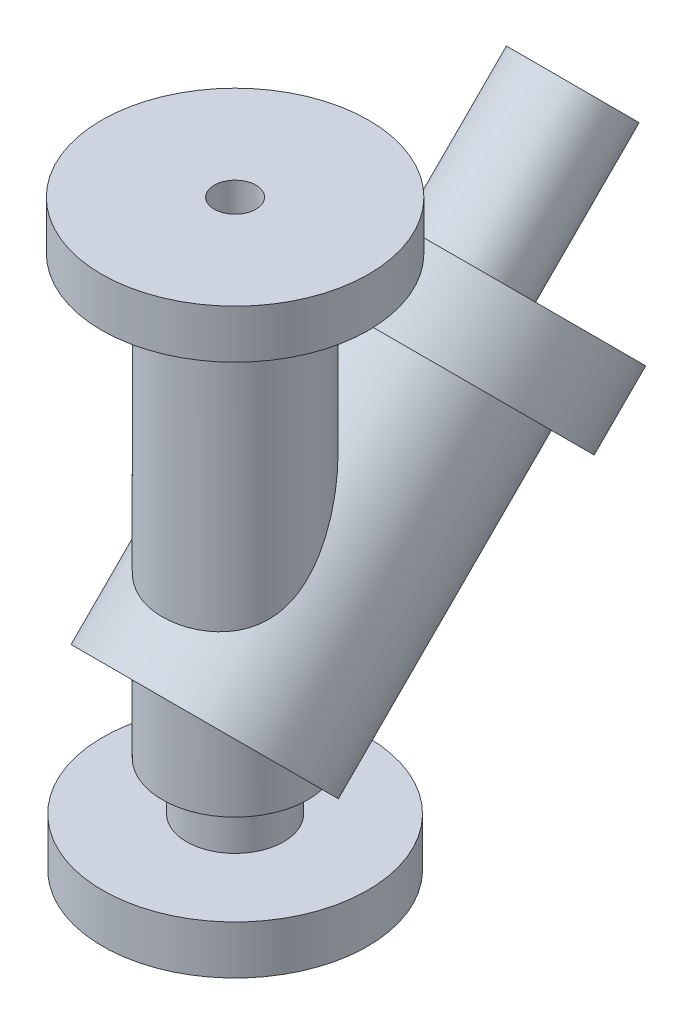
ISO-10303-21;
HEADER;
FILE_DESCRIPTION(('STEP AP214'),'2;1');
FILE_NAME('part.step','',(''),(''),'','','');
FILE_SCHEMA(('AUTOMOTIVE_DESIGN { 1 0 10303 214 1 1 1 1 }'));
ENDSEC;
DATA;
#1=APPLICATION_CONTEXT('core data for automotive mechanical design processes');
#2=APPLICATION_PROTOCOL_DEFINITION('international standard','automotive_design',2000,#1);
#3=PRODUCT_CONTEXT('',#1,'mechanical');
#4=PRODUCT('Part','Part','',(#3));
#5=PRODUCT_RELATED_PRODUCT_CATEGORY('part','',(#4));
#6=PRODUCT_DEFINITION_FORMATION('','',#4);
#7=PRODUCT_DEFINITION_CONTEXT('part definition',#1,'design');
#8=PRODUCT_DEFINITION('design','',#6,#7);
#9=PRODUCT_DEFINITION_SHAPE('','',#8);
#10=(LENGTH_UNIT() NAMED_UNIT(*) SI_UNIT(.MILLI.,.METRE.));
#11=(NAMED_UNIT(*) PLANE_ANGLE_UNIT() SI_UNIT($,.RADIAN.));
#12=(NAMED_UNIT(*) SI_UNIT($,.STERADIAN.) SOLID_ANGLE_UNIT());
#13=UNCERTAINTY_MEASURE_WITH_UNIT(LENGTH_MEASURE(1.E-05),#10,'distance_accuracy_value','');
#14=(GEOMETRIC_REPRESENTATION_CONTEXT(3) GLOBAL_UNCERTAINTY_ASSIGNED_CONTEXT((#13)) GLOBAL_UNIT_ASSIGNED_CONTEXT((#10,
#11,#12)) REPRESENTATION_CONTEXT('',''));
#15=CARTESIAN_POINT('',(0.,0.,0.));
#16=DIRECTION('',(0.,0.,1.));
#17=DIRECTION('',(1.,0.,0.));
#18=AXIS2_PLACEMENT_3D('',#15,#16,#17);
#19=CARTESIAN_POINT('',(0.,152.4,0.));
#20=DIRECTION('',(0.,-1.,0.));
#21=DIRECTION('',(0.,0.,-1.));
#22=AXIS2_PLACEMENT_3D('',#19,#20,#21);
#23=CYLINDRICAL_SURFACE('',#22,19.05);
#24=CARTESIAN_POINT('',(0.,104.929873903962,-19.05));
#25=CARTESIAN_POINT('',(-0.267009906651442,104.929877124801,-19.0500015955188));
#26=CARTESIAN_POINT('',(-0.533997791989519,104.918941830051,-19.0443737127495));
#27=CARTESIAN_POINT('',(-1.06571573927213,104.875538104068,-19.0220277013723));
#28=CARTESIAN_POINT('',(-1.33044604152047,104.843071994361,-19.0053107684242));
#29=CARTESIAN_POINT('',(-1.85584052785153,104.757496276019,-18.9612215721552));
#30=CARTESIAN_POINT('',(-2.11650127472153,104.704370105082,-18.9338407600244));
#31=CARTESIAN_POINT('',(-2.63187326271433,104.578872624724,-18.869108057032));
#32=CARTESIAN_POINT('',(-2.8865836066686,104.506498433308,-18.8317546729796));
#33=CARTESIAN_POINT('',(-3.4512221544691,104.323990811808,-18.7374641875761));
#34=CARTESIAN_POINT('',(-3.75913957224057,104.208943392837,-18.6779671382901));
#35=CARTESIAN_POINT('',(-4.3621005332743,103.95499212376,-18.5464261974273));
#36=CARTESIAN_POINT('',(-4.65714061774455,103.816081913071,-18.4743789605494));
#37=CARTESIAN_POINT('',(-5.52267661532365,103.368318141473,-18.2417048611953));
#38=CARTESIAN_POINT('',(-6.07299815278931,103.028633911163,-18.0646498055544));
#39=CARTESIAN_POINT('',(-7.02299807661898,102.359318279681,-17.7140478372508));
#40=CARTESIAN_POINT('',(-7.43176629372052,102.039330464189,-17.545846025037));
#41=CARTESIAN_POINT('',(-8.21668630471617,101.369716113327,-17.1922588623011));
#42=CARTESIAN_POINT('',(-8.59281576517244,101.020069602177,-17.0068619225081));
#43=CARTESIAN_POINT('',(-9.31567536291714,100.297826758976,-16.6219344606117));
#44=CARTESIAN_POINT('',(-9.66235570397833,99.9251933243599,-16.4223810066575));
#45=CARTESIAN_POINT('',(-10.3287874869254,99.162515873639,-16.0116164951536));
#46=CARTESIAN_POINT('',(-10.6485287606971,98.7724653677207,-15.800401085166));
#47=CARTESIAN_POINT('',(-11.2588363570715,97.9850917072852,-15.3713391294279));
#48=CARTESIAN_POINT('',(-11.5497767985285,97.5879737098165,-15.1536452403363));
#49=CARTESIAN_POINT('',(-12.1101224360225,96.7836154725401,-14.7096963045043));
#50=CARTESIAN_POINT('',(-12.3795304661401,96.3763765741185,-14.4834423902231));
#51=CARTESIAN_POINT('',(-12.8989262044688,95.5535406848813,-14.0228661822539));
#52=CARTESIAN_POINT('',(-13.1488954917535,95.1379362248209,-13.7885365319139));
#53=CARTESIAN_POINT('',(-13.6306653785616,94.3004901021073,-13.3124804156925));
#54=CARTESIAN_POINT('',(-13.8624654589282,93.8786482616397,-13.0707537387267));
#55=CARTESIAN_POINT('',(-14.3098769121617,93.0287874775481,-12.5793754319443));
#56=CARTESIAN_POINT('',(-14.5254323060473,92.6007527372258,-12.3297002707768));
#57=CARTESIAN_POINT('',(-14.9405209068686,91.7411214012904,-11.823303709162));
#58=CARTESIAN_POINT('',(-15.1400543249961,91.3095248527096,-11.5665824016525));
#59=CARTESIAN_POINT('',(-15.5238237428971,90.4440293946605,-11.0461702362674));
#60=CARTESIAN_POINT('',(-15.7080660837712,90.010131519759,-10.7824823278036));
#61=CARTESIAN_POINT('',(-16.0619489605107,89.1408358691651,-10.2478801057345));
#62=CARTESIAN_POINT('',(-16.2315893174273,88.705438075159,-9.97696570362107));
#63=CARTESIAN_POINT('',(-16.5771047811677,87.7793431611689,-9.39314541336794));
#64=CARTESIAN_POINT('',(-16.7510867218115,87.288569170848,-9.07923924780995));
#65=CARTESIAN_POINT('',(-17.081404474407,86.307590074086,-8.44139257463615));
#66=CARTESIAN_POINT('',(-17.2377399379828,85.817384979065,-8.11745186907981));
#67=CARTESIAN_POINT('',(-17.5328707914166,84.8386022009264,-7.45863973165529));
#68=CARTESIAN_POINT('',(-17.6716561225594,84.350025605945,-7.12376216851334));
#69=CARTESIAN_POINT('',(-17.9312902822868,83.3762244132712,-6.44237977729743));
#70=CARTESIAN_POINT('',(-18.0521394673175,82.8909997491484,-6.09587518045609));
#71=CARTESIAN_POINT('',(-18.2747897834614,81.9275474633776,-5.39169260400928));
#72=CARTESIAN_POINT('',(-18.3766696959188,81.4492988670831,-5.03406837781814));
#73=CARTESIAN_POINT('',(-18.5609900787698,80.4994976849631,-4.30505847509164));
#74=CARTESIAN_POINT('',(-18.6434291662506,80.0279455777297,-3.93367182174641));
#75=CARTESIAN_POINT('',(-18.7872929804933,79.0941888793937,-3.17625361290259));
#76=CARTESIAN_POINT('',(-18.8487379182231,78.631975703467,-2.7902365421195));
#77=CARTESIAN_POINT('',(-18.9486749225377,77.7191256470406,-2.00200537017117));
#78=CARTESIAN_POINT('',(-18.9871724384102,77.2684860425258,-1.59979513860814));
#79=CARTESIAN_POINT('',(-19.0367319764828,76.4134085507067,-0.807185836171903));
#80=CARTESIAN_POINT('',(-19.0495528387087,76.0079660779016,-0.417986021192688));
#81=CARTESIAN_POINT('',(-19.0504241997063,75.2127243599245,0.376156773187768));
#82=CARTESIAN_POINT('',(-19.0384766937626,74.8229238572487,0.781098481878454));
#83=CARTESIAN_POINT('',(-18.9866192768058,74.0625857341306,1.6068036252037));
#84=CARTESIAN_POINT('',(-18.9467200896439,73.6920407847108,2.02756093350896));
#85=CARTESIAN_POINT('',(-18.8353163814849,72.9739884690959,2.88443663295627));
#86=CARTESIAN_POINT('',(-18.7638112570611,72.6264815428929,3.32055531723436));
#87=CARTESIAN_POINT('',(-18.5840328166851,71.9539519889694,4.21261013207123));
#88=CARTESIAN_POINT('',(-18.4752526941285,71.6293178870567,4.66873954212559));
#89=CARTESIAN_POINT('',(-18.2172588753814,71.01224462937,5.59135766968807));
#90=CARTESIAN_POINT('',(-18.068047028027,70.7198040023327,6.05784591261882));
#91=CARTESIAN_POINT('',(-17.7261849504042,70.1708331946425,6.99523639633095));
#92=CARTESIAN_POINT('',(-17.5335911156406,69.9142570865692,7.46613215245236));
#93=CARTESIAN_POINT('',(-17.1028855641815,69.4384889119164,8.40599698235498));
#94=CARTESIAN_POINT('',(-16.8647806608429,69.2192912587775,8.87496633381236));
#95=CARTESIAN_POINT('',(-16.3763768184818,68.8440742559226,9.74330751440538));
#96=CARTESIAN_POINT('',(-16.1316054786585,68.6835532719279,10.1438587013558));
#97=CARTESIAN_POINT('',(-15.6079897041798,68.3895571804856,10.9323861643844));
#98=CARTESIAN_POINT('',(-15.3291476249674,68.2560802050742,11.3203633074116));
#99=CARTESIAN_POINT('',(-14.7386771459008,68.0139426770407,12.0791220227073));
#100=CARTESIAN_POINT('',(-14.4270263510976,67.9052992381122,12.449891597219));
#101=CARTESIAN_POINT('',(-13.7731498564126,67.7101655355878,13.1696334152723));
#102=CARTESIAN_POINT('',(-13.4309238905469,67.6236754647368,13.5186054691448));
#103=CARTESIAN_POINT('',(-12.7385239704174,67.4741401485616,14.1720203676467));
#104=CARTESIAN_POINT('',(-12.3898955606616,67.4100451932685,14.4778655422354));
#105=CARTESIAN_POINT('',(-11.6698427314182,67.2962431304556,15.0642906640596));
#106=CARTESIAN_POINT('',(-11.2984196667045,67.246535168863,15.344872110375));
#107=CARTESIAN_POINT('',(-10.5351052731293,67.1590323260952,15.8786316760456));
#108=CARTESIAN_POINT('',(-10.14321535888,67.1212366228443,16.1318116856065));
#109=CARTESIAN_POINT('',(-9.34129787267234,67.0552966179366,16.6090457273214));
#110=CARTESIAN_POINT('',(-8.93126914970987,67.0271529297462,16.8330979075961));
#111=CARTESIAN_POINT('',(-8.05902924726748,66.976409537401,17.2688289323526));
#112=CARTESIAN_POINT('',(-7.59538531394566,66.9545071408557,17.4777257945609));
#113=CARTESIAN_POINT('',(-6.65263796052381,66.9176008484949,17.8578629620113));
#114=CARTESIAN_POINT('',(-6.17353381394726,66.9025972773624,18.0291014947224));
#115=CARTESIAN_POINT('',(-5.20291640238031,66.8777482698401,18.3327793764631));
#116=CARTESIAN_POINT('',(-4.71139995271479,66.8679041716252,18.4652086558963));
#117=CARTESIAN_POINT('',(-3.71928914545974,66.852058362118,18.6903223096332));
#118=CARTESIAN_POINT('',(-3.21869466111837,66.8460567045183,18.7830061285458));
#119=CARTESIAN_POINT('',(-2.18970365959683,66.8367839776397,18.9311784345093));
#120=CARTESIAN_POINT('',(-1.66104630597213,66.8336433138397,18.9848698111441));
#121=CARTESIAN_POINT('',(-0.601074789870358,66.8299796075181,19.0479161524016));
#122=CARTESIAN_POINT('',(-0.0697605415935067,66.8294566500843,19.057269675833));
#123=CARTESIAN_POINT('',(0.9918236624238,66.8309302146658,19.0315712044242));
#124=CARTESIAN_POINT('',(1.52209355314277,66.8329268888773,18.9965165271402));
#125=CARTESIAN_POINT('',(2.57783232287044,66.8398110506646,18.8822454353525));
#126=CARTESIAN_POINT('',(3.10330121795305,66.8446985285582,18.8030291687584));
#127=CARTESIAN_POINT('',(4.14927501493832,66.8582550079976,18.6003149438458));
#128=CARTESIAN_POINT('',(4.66972224931263,66.8669493795394,18.4765209095688));
#129=CARTESIAN_POINT('',(5.69827342865243,66.8894810147836,18.1856484973509));
#130=CARTESIAN_POINT('',(6.2063772344809,66.9033183364295,18.018569631744));
#131=CARTESIAN_POINT('',(7.2066515236115,66.9380027553575,17.6423425768452));
#132=CARTESIAN_POINT('',(7.69881851964043,66.958851375631,17.4331852512571));
#133=CARTESIAN_POINT('',(8.6634497898219,67.0099354468133,16.9744618024075));
#134=CARTESIAN_POINT('',(9.13591425559491,67.0401708064056,16.7248960722604));
#135=CARTESIAN_POINT('',(10.0537939018391,67.1126173127173,16.1896162261133));
#136=CARTESIAN_POINT('',(10.4993976777596,67.1547291536965,15.9042123118299));
#137=CARTESIAN_POINT('',(11.3642262237892,67.2542961334591,15.2982226875647));
#138=CARTESIAN_POINT('',(11.7834508661227,67.3117513465559,14.9776368071886));
#139=CARTESIAN_POINT('',(12.5919054044275,67.4455919257159,14.3046446410037));
#140=CARTESIAN_POINT('',(12.9811530271698,67.5219659897607,13.9522574327428));
#141=CARTESIAN_POINT('',(13.7267190955125,67.6974585176767,13.2194110233932));
#142=CARTESIAN_POINT('',(14.0830400163127,67.796575269957,12.8389539362754));
#143=CARTESIAN_POINT('',(14.7412106740335,68.0150198359984,12.0763703875601));
#144=CARTESIAN_POINT('',(15.0449817323992,68.1329295000256,11.6954960253473));
#145=CARTESIAN_POINT('',(15.6186421685419,68.3950033552871,10.9176012695559));
#146=CARTESIAN_POINT('',(15.8885335917983,68.5391659602137,10.5205818526512));
#147=CARTESIAN_POINT('',(16.3929739392817,68.855547201103,9.71587711635006));
#148=CARTESIAN_POINT('',(16.6275489238865,69.0277449523885,9.30819992475349));
#149=CARTESIAN_POINT('',(17.0611763888053,69.4011390066832,8.48729913632562));
#150=CARTESIAN_POINT('',(17.2602301672139,69.6023342495162,8.07407574276951));
#151=CARTESIAN_POINT('',(17.6092461889304,70.0166085035173,7.27945265965943));
#152=CARTESIAN_POINT('',(17.7618223172347,70.2275465742856,6.89807719408002));
#153=CARTESIAN_POINT('',(18.038377064408,70.672684963061,6.13862960810494));
#154=CARTESIAN_POINT('',(18.1623577552795,70.9068835938664,5.76055725027992));
#155=CARTESIAN_POINT('',(18.383423457837,71.3968947215594,5.01050934363137));
#156=CARTESIAN_POINT('',(18.4805003027898,71.6527137506917,4.63853567824933));
#157=CARTESIAN_POINT('',(18.6497315336113,72.1838213752925,3.90288597096551));
#158=CARTESIAN_POINT('',(18.7218823169992,72.4591127781175,3.53921113555372));
#159=CARTESIAN_POINT('',(18.830430980913,72.9662645672377,2.89816246467469));
#160=CARTESIAN_POINT('',(18.8711720332656,73.1948681396291,2.61892274416046));
#161=CARTESIAN_POINT('',(18.9395891162268,73.6615813345527,2.0668366703548));
#162=CARTESIAN_POINT('',(18.9672635363239,73.8996921249647,1.79399110910413));
#163=CARTESIAN_POINT('',(19.0322050660295,74.6268391479508,0.985192808650225));
#164=CARTESIAN_POINT('',(19.0513687970981,75.1285834183464,0.459112170454146));
#165=CARTESIAN_POINT('',(19.048474410192,76.1597703076458,-0.568435464011953));
#166=CARTESIAN_POINT('',(19.026264247399,76.6893081132372,-1.06980469646597));
#167=CARTESIAN_POINT('',(18.9459842132393,77.7680583373719,-2.0476216229285));
#168=CARTESIAN_POINT('',(18.887917699071,78.3172689094372,-2.52407164557108));
#169=CARTESIAN_POINT('',(18.7468234128673,79.3798391750629,-3.41209732284076));
#170=CARTESIAN_POINT('',(18.6665355710914,79.8919355923275,-3.82563862648874));
#171=CARTESIAN_POINT('',(18.4820162417541,80.9252578425515,-4.63575004300507));
#172=CARTESIAN_POINT('',(18.3777805721785,81.4464852553557,-5.03231717730466));
#173=CARTESIAN_POINT('',(18.1468340945311,82.4958707489965,-5.81030812880027));
#174=CARTESIAN_POINT('',(18.0201047058195,83.0240342226925,-6.19171910520644));
#175=CARTESIAN_POINT('',(17.7451946752965,84.0846868515724,-6.94043076383144));
#176=CARTESIAN_POINT('',(17.5970153141743,84.6171757467129,-7.30773228681183));
#177=CARTESIAN_POINT('',(17.279663388491,85.6845663736649,-8.02938878184655));
#178=CARTESIAN_POINT('',(17.1104929746766,86.2194678528798,-8.38374507546329));
#179=CARTESIAN_POINT('',(16.7511366349376,87.2900210619187,-9.08050527149966));
#180=CARTESIAN_POINT('',(16.5609499394856,87.8256728185051,-9.42290873565272));
#181=CARTESIAN_POINT('',(16.1592808472146,88.8956582776762,-10.0962228364535));
#182=CARTESIAN_POINT('',(15.9478131297234,89.4299926318551,-10.4271411863186));
#183=CARTESIAN_POINT('',(15.5026621408309,90.4959272309863,-11.0781513078713));
#184=CARTESIAN_POINT('',(15.2689808850311,91.0275277193974,-11.3982440582802));
#185=CARTESIAN_POINT('',(14.7459112581444,92.1556609127138,-12.0691592423252));
#186=CARTESIAN_POINT('',(14.4532368005875,92.7515590154366,-12.418501344432));
#187=CARTESIAN_POINT('',(13.8352726280303,93.9343692932322,-13.1034545819851));
#188=CARTESIAN_POINT('',(13.5099809201526,94.5212809167127,-13.4390648766673));
#189=CARTESIAN_POINT('',(12.8237036590629,95.6815119023501,-14.0954054548285));
#190=CARTESIAN_POINT('',(12.4627595339513,96.2548461026118,-14.4161523871102));
#191=CARTESIAN_POINT('',(11.8910630468379,97.100976032471,-14.885083188768));
#192=CARTESIAN_POINT('',(11.6954651185635,97.3806889577769,-15.0393518128724));
#193=CARTESIAN_POINT('',(11.2934616480785,97.9346547047492,-15.3435257025243));
#194=CARTESIAN_POINT('',(11.0870567673567,98.208907859191,-15.4934312342631));
#195=CARTESIAN_POINT('',(10.5854913221852,98.8495588279655,-15.8421640915366));
#196=CARTESIAN_POINT('',(10.2853512469721,99.2131952807221,-16.0389569078196));
#197=CARTESIAN_POINT('',(9.66132881200667,99.9253265614288,-16.4224040407378));
#198=CARTESIAN_POINT('',(9.33744349987313,100.27381949789,-16.6090570915979));
#199=CARTESIAN_POINT('',(8.66401195364686,100.950897237666,-16.9700674017581));
#200=CARTESIAN_POINT('',(8.31450280033963,101.279509600137,-17.1444417399318));
#201=CARTESIAN_POINT('',(7.58698967035173,101.911667947613,-17.4785641567437));
#202=CARTESIAN_POINT('',(7.20900064413373,102.215226911387,-17.63831981323));
#203=CARTESIAN_POINT('',(6.56883505548972,102.682845946557,-17.8835878942573));
#204=CARTESIAN_POINT('',(6.31594232667944,102.856761383559,-17.9745954054757));
#205=CARTESIAN_POINT('',(5.79760551798091,103.189570778865,-18.1484160777981));
#206=CARTESIAN_POINT('',(5.53215910720428,103.348461930998,-18.2312277082449));
#207=CARTESIAN_POINT('',(4.98880780329007,103.648488680961,-18.3873366450106));
#208=CARTESIAN_POINT('',(4.71090779691706,103.789631162002,-18.460637640055));
#209=CARTESIAN_POINT('',(4.14307799234554,104.051223984334,-18.5963041619315));
#210=CARTESIAN_POINT('',(3.85315517854338,104.171686136019,-18.658675930793));
#211=CARTESIAN_POINT('',(3.27595346005935,104.383835762157,-18.7683999480433));
#212=CARTESIAN_POINT('',(2.9891817026625,104.476603098772,-18.8163169521801));
#213=CARTESIAN_POINT('',(2.4070867173598,104.637960586895,-18.899598615989));
#214=CARTESIAN_POINT('',(2.11176399900204,104.706552175829,-18.9349640219474));
#215=CARTESIAN_POINT('',(1.5153308403487,104.817215339596,-18.9919945078179));
#216=CARTESIAN_POINT('',(1.21423026434197,104.859328576105,-19.0136811104606));
#217=CARTESIAN_POINT('',(0.608743272382473,104.915654038574,-19.042681925187));
#218=CARTESIAN_POINT('',(0.304357329934899,104.929870232615,-19.0499981813115));
#219=CARTESIAN_POINT('',(0.,104.929873903962,-19.05));
#220=B_SPLINE_CURVE_WITH_KNOTS('',3,(#24,#25,#26,#27,#28,#29,#30,#31,#32,#33,#34,#35,#36,#37,
#38,#39,#40,#41,#42,#43,#44,#45,#46,#47,#48,#49,#50,#51,#52,#53,#54,#55,#56,#57,#58,#59,#60,#61,
#62,#63,#64,#65,#66,#67,#68,#69,#70,#71,#72,#73,#74,#75,#76,#77,#78,#79,#80,#81,#82,#83,#84,#85,
#86,#87,#88,#89,#90,#91,#92,#93,#94,#95,#96,#97,#98,#99,#100,#101,#102,#103,#104,#105,#106,#107,
#108,#109,#110,#111,#112,#113,#114,#115,#116,#117,#118,#119,#120,#121,#122,#123,#124,#125,#126,
#127,#128,#129,#130,#131,#132,#133,#134,#135,#136,#137,#138,#139,#140,#141,#142,#143,#144,#145,
#146,#147,#148,#149,#150,#151,#152,#153,#154,#155,#156,#157,#158,#159,#160,#161,#162,#163,#164,
#165,#166,#167,#168,#169,#170,#171,#172,#173,#174,#175,#176,#177,#178,#179,#180,#181,#182,#183,
#184,#185,#186,#187,#188,#189,#190,#191,#192,#193,#194,#195,#196,#197,#198,#199,#200,#201,#202,
#203,#204,#205,#206,#207,#208,#209,#210,#211,#212,#213,#214,#215,#216,#217,#218,#219),
.UNSPECIFIED.,.T.,.F.,(4,2,2,2,2,2,2,2,2,2,2,2,2,2,2,2,2,2,2,2,2,2,2,2,2,2,2,2,2,2,2,2,2,2,2,2,
2,2,2,2,2,2,2,2,2,2,2,2,2,2,2,2,2,2,2,2,2,2,2,2,2,2,2,2,2,2,2,2,2,2,2,2,2,2,2,2,2,2,2,2,2,2,2,2,
2,2,2,2,2,2,2,2,2,2,2,2,2,4),(0.,0.800712843955493,1.60133936631104,2.40260904477865,
3.20399876452086,4.20457298011912,5.20541431192065,7.20897089637736,8.84399584968337,
10.4801309074278,12.1189796478342,13.7584442238176,15.3726054987658,16.9865539678979,
18.6020136985121,20.2175195715536,21.8383595263883,23.4591781128151,25.0793211634962,
26.6994840663727,28.5231444653239,30.3468408605894,32.1715778002674,33.9962784719717,
35.813223157982,37.6302970524307,39.4456166969422,41.2605050884779,42.9461243411954,
44.6316078094527,46.3164449844723,48.0013143281163,49.7100659700834,51.418739488521,
53.1252044634634,54.8314141672968,56.3177021357741,57.8038874094448,59.2910938002439,
60.7783131300222,62.1813766504321,63.5843568619845,64.987240231407,66.390212749305,
67.9155073025332,69.4408736341317,70.9666353933722,72.4924184724515,74.0846989265194,
75.6770311369244,77.2694595355323,78.8618826006723,80.4650834075347,82.0683022775477,
83.6718696232808,85.2754213695956,86.8659434266024,88.4564731872081,90.0460550558439,
91.6355173334264,93.137216476667,94.6388249113342,96.1393198042104,97.6397598514502,
99.0235149811074,100.407169813463,101.791244198991,103.175518536584,104.264606723348,
105.353829109297,107.532789062048,109.719772270109,111.906550743903,113.895095582905,
115.883987946216,117.874530919206,119.86495509409,121.855175497933,123.845468799397,
125.834398516163,127.823147934326,130.072902229253,132.322794065507,134.57010161438,
135.693603092419,136.817035881641,138.349027691027,139.881210305825,141.4112178442,
142.940427729692,143.900231731978,144.860214649688,145.819824115298,146.778883718234,
147.693220913461,148.607503735405,149.520344378916,150.433055170388),.UNSPECIFIED.);
#221=CARTESIAN_POINT('',(0.,104.929873903962,-19.05));
#222=VERTEX_POINT('',#221);
#223=EDGE_CURVE('E94',#222,#222,#220,.T.);
#224=ORIENTED_EDGE('',*,*,#223,.T.);
#225=EDGE_LOOP('',(#224));
#226=FACE_BOUND('',#225,.T.);
#227=CARTESIAN_POINT('',(0.,139.7,0.));
#228=DIRECTION('',(0.,1.,0.));
#229=DIRECTION('',(0.,0.,1.));
#230=AXIS2_PLACEMENT_3D('',#227,#228,#229);
#231=CIRCLE('',#230,19.05);
#232=CARTESIAN_POINT('',(0.,139.7,19.05));
#233=VERTEX_POINT('',#232);
#234=EDGE_CURVE('E12',#233,#233,#231,.T.);
#235=ORIENTED_EDGE('',*,*,#234,.F.);
#236=EDGE_LOOP('',(#235));
#237=FACE_BOUND('',#236,.T.);
#238=ADVANCED_FACE('F32',(#226,#237),#23,.T.);
#239=CARTESIAN_POINT('',(0.,106.681360679575,-61.2126393204245));
#240=DIRECTION('',(0.,0.707106781186551,-0.707106781186544));
#241=DIRECTION('',(0.,0.707106781186544,0.707106781186551));
#242=AXIS2_PLACEMENT_3D('',#239,#240,#241);
#243=PLANE('',#242);
#244=CARTESIAN_POINT('',(0.,106.681360679575,-61.2126393204245));
#245=DIRECTION('',(0.,-0.707106781186551,0.707106781186544));
#246=DIRECTION('',(0.,-0.707106781186544,-0.707106781186551));
#247=AXIS2_PLACEMENT_3D('',#244,#245,#246);
#248=CIRCLE('',#247,37.719);
#249=CARTESIAN_POINT('',(0.,80.01,-87.884));
#250=VERTEX_POINT('',#249);
#251=EDGE_CURVE('E153',#250,#250,#248,.T.);
#252=ORIENTED_EDGE('',*,*,#251,.F.);
#253=EDGE_LOOP('',(#252));
#254=FACE_BOUND('',#253,.T.);
#255=CARTESIAN_POINT('',(0.,106.681360679575,-61.2126393204245));
#256=DIRECTION('',(0.,0.707106781186551,-0.707106781186544));
#257=DIRECTION('',(0.,0.707106781186544,0.707106781186551));
#258=AXIS2_PLACEMENT_3D('',#255,#256,#257);
#259=CIRCLE('',#258,14.1871203416822);
#260=CARTESIAN_POINT('',(0.,116.713169678688,-51.1808303213113));
#261=VERTEX_POINT('',#260);
#262=EDGE_CURVE('E146',#261,#261,#259,.T.);
#263=ORIENTED_EDGE('',*,*,#262,.F.);
#264=EDGE_LOOP('',(#263));
#265=FACE_BOUND('',#264,.T.);
#266=ADVANCED_FACE('F110',(#254,#265),#243,.T.);
#267=CARTESIAN_POINT('',(0.,25.4,0.));
#268=DIRECTION('',(0.,-1.,0.));
#269=DIRECTION('',(0.,0.,-1.));
#270=AXIS2_PLACEMENT_3D('',#267,#268,#269);
#271=CYLINDRICAL_SURFACE('',#270,12.7);
#272=CARTESIAN_POINT('',(0.,12.7,0.));
#273=DIRECTION('',(0.,-1.,0.));
#274=DIRECTION('',(0.,0.,-1.));
#275=AXIS2_PLACEMENT_3D('',#272,#273,#274);
#276=CIRCLE('',#275,12.7);
#277=CARTESIAN_POINT('',(0.,12.7,-12.7));
#278=VERTEX_POINT('',#277);
#279=EDGE_CURVE('E87',#278,#278,#276,.T.);
#280=ORIENTED_EDGE('',*,*,#279,.F.);
#281=EDGE_LOOP('',(#280));
#282=FACE_BOUND('',#281,.T.);
#283=CARTESIAN_POINT('',(0.,29.5980557355349,0.));
#284=DIRECTION('',(0.,0.707106781186551,-0.707106781186544));
#285=DIRECTION('',(0.,-0.707106781186544,-0.707106781186551));
#286=AXIS2_PLACEMENT_3D('',#283,#284,#285);
#287=ELLIPSE('',#286,17.9605122421382,12.7);
#288=CARTESIAN_POINT('',(-3.92295310446291,17.5191303305089,-12.0789254050261));
#289=VERTEX_POINT('',#288);
#290=CARTESIAN_POINT('',(-11.9860889384879,25.4,-4.19805573553491));
#291=VERTEX_POINT('',#290);
#292=EDGE_CURVE('E48',#289,#291,#287,.T.);
#293=ORIENTED_EDGE('',*,*,#292,.F.);
#294=CARTESIAN_POINT('',(-3.92295310446291,17.5191303305089,-12.0789254050261));
#295=CARTESIAN_POINT('',(-3.76285993056821,17.5397438605781,-12.1309206375009));
#296=CARTESIAN_POINT('',(-3.60158952452861,17.5589511416917,-12.1797775664688));
#297=CARTESIAN_POINT('',(-3.27695013107085,17.5946168798933,-12.2711056937808));
#298=CARTESIAN_POINT('',(-3.11358114213913,17.6110753349985,-12.313576887519));
#299=CARTESIAN_POINT('',(-2.62081487810544,17.6564133249643,-12.4312231485566));
#300=CARTESIAN_POINT('',(-2.2886562441496,17.6812685024924,-12.4966640749915));
#301=CARTESIAN_POINT('',(-1.62882156963224,17.7200572255834,-12.5994203055092));
#302=CARTESIAN_POINT('',(-1.30127317243977,17.7342721249416,-12.6374590755999));
#303=CARTESIAN_POINT('',(-0.643935535587166,17.7531012989664,-12.6879464114579));
#304=CARTESIAN_POINT('',(-0.314146385172248,17.7577159537709,-12.7003959904721));
#305=CARTESIAN_POINT('',(0.342864914606357,17.7574156909785,-12.6995878994325));
#306=CARTESIAN_POINT('',(0.670087358454526,17.7525735682131,-12.6865266027568));
#307=CARTESIAN_POINT('',(1.32226961106467,17.7334326820859,-12.6352133395727));
#308=CARTESIAN_POINT('',(1.64722935980012,17.7191336688031,-12.5969607073227));
#309=CARTESIAN_POINT('',(2.30177528061324,17.6803262570148,-12.4941820231705));
#310=CARTESIAN_POINT('',(2.63123569594599,17.6555428403554,-12.4289493673958));
#311=CARTESIAN_POINT('',(3.12002906687034,17.610436317138,-12.3119263825077));
#312=CARTESIAN_POINT('',(3.28208639490022,17.5940756252599,-12.2697146841832));
#313=CARTESIAN_POINT('',(3.60413315298851,17.5586481248609,-12.1790067616979));
#314=CARTESIAN_POINT('',(3.76412258405859,17.539581317664,-12.1305105406118));
#315=CARTESIAN_POINT('',(3.92295310446291,17.5191303305089,-12.0789254050261));
#316=B_SPLINE_CURVE_WITH_KNOTS('',3,(#294,#295,#296,#297,#298,#299,#300,#301,#302,#303,#304,
#305,#306,#307,#308,#309,#310,#311,#312,#313,#314,#315),.UNSPECIFIED.,.F.,.F.,(4,2,2,2,2,2,2,2,
2,2,4),(0.,0.508665313340147,1.01733099356859,2.03433910781017,3.02340018537466,4.0124220986517,
4.99386088161903,5.97532560250374,6.98430949573214,7.48896453722722,7.99361933182093),.UNSPECIFIED.);
#317=CARTESIAN_POINT('',(3.92295310446289,17.5191303305089,-12.0789254050261));
#318=VERTEX_POINT('',#317);
#319=EDGE_CURVE('E52',#289,#318,#316,.T.);
#320=ORIENTED_EDGE('',*,*,#319,.T.);
#321=CARTESIAN_POINT('',(11.9860889384879,25.4,-4.19805573553491));
#322=VERTEX_POINT('',#321);
#323=EDGE_CURVE('E82',#322,#318,#287,.T.);
#324=ORIENTED_EDGE('',*,*,#323,.F.);
#325=CARTESIAN_POINT('',(0.,25.4,0.));
#326=DIRECTION('',(0.,1.,0.));
#327=DIRECTION('',(0.,0.,1.));
#328=AXIS2_PLACEMENT_3D('',#325,#326,#327);
#329=CIRCLE('',#328,12.7);
#330=EDGE_CURVE('E80',#291,#322,#329,.T.);
#331=ORIENTED_EDGE('',*,*,#330,.F.);
#332=EDGE_LOOP('',(#293,#320,#324,#331));
#333=FACE_BOUND('',#332,.T.);
#334=ADVANCED_FACE('F34',(#282,#333),#271,.T.);
#335=CARTESIAN_POINT('',(0.,25.4,0.));
#336=DIRECTION('',(0.,-1.,0.));
#337=DIRECTION('',(0.,0.,-1.));
#338=AXIS2_PLACEMENT_3D('',#335,#336,#337);
#339=CYLINDRICAL_SURFACE('',#338,5.461);
#340=CARTESIAN_POINT('',(0.,0.,0.));
#341=DIRECTION('',(0.,1.,0.));
#342=DIRECTION('',(0.,0.,1.));
#343=AXIS2_PLACEMENT_3D('',#340,#341,#342);
#344=CIRCLE('',#343,5.461);
#345=CARTESIAN_POINT('',(0.,0.,5.461));
#346=VERTEX_POINT('',#345);
#347=EDGE_CURVE('E73',#346,#346,#344,.T.);
#348=ORIENTED_EDGE('',*,*,#347,.F.);
#349=EDGE_LOOP('',(#348));
#350=FACE_BOUND('',#349,.T.);
#351=CARTESIAN_POINT('',(0.,152.4,0.));
#352=DIRECTION('',(0.,-1.,0.));
#353=DIRECTION('',(0.,0.,-1.));
#354=AXIS2_PLACEMENT_3D('',#351,#352,#353);
#355=CIRCLE('',#354,5.461);
#356=CARTESIAN_POINT('',(0.,152.4,-5.461));
#357=VERTEX_POINT('',#356);
#358=EDGE_CURVE('E137',#357,#357,#355,.T.);
#359=ORIENTED_EDGE('',*,*,#358,.F.);
#360=EDGE_LOOP('',(#359));
#361=FACE_BOUND('',#360,.T.);
#362=ADVANCED_FACE('F132',(#350,#361),#339,.F.);
#363=CARTESIAN_POINT('',(0.,25.4,0.));
#364=DIRECTION('',(0.,1.,0.));
#365=DIRECTION('',(0.,0.,1.));
#366=AXIS2_PLACEMENT_3D('',#363,#364,#365);
#367=PLANE('',#366);
#368=DIRECTION('',(-1.,0.,0.));
#369=VECTOR('',#368,1.);
#370=CARTESIAN_POINT('',(0.,25.4,-4.19805573553491));
#371=LINE('',#370,#369);
#372=CARTESIAN_POINT('',(18.5816799036401,25.4,-4.19805573553494));
#373=VERTEX_POINT('',#372);
#374=EDGE_CURVE('E78',#373,#322,#371,.T.);
#375=ORIENTED_EDGE('',*,*,#374,.F.);
#376=CARTESIAN_POINT('',(0.,25.4,0.));
#377=DIRECTION('',(0.,1.,0.));
#378=DIRECTION('',(0.,0.,1.));
#379=AXIS2_PLACEMENT_3D('',#376,#377,#378);
#380=CIRCLE('',#379,19.05);
#381=CARTESIAN_POINT('',(-18.5816799036401,25.4,-4.19805573553494));
#382=VERTEX_POINT('',#381);
#383=EDGE_CURVE('E66',#382,#373,#380,.T.);
#384=ORIENTED_EDGE('',*,*,#383,.F.);
#385=EDGE_CURVE('E83',#291,#382,#371,.T.);
#386=ORIENTED_EDGE('',*,*,#385,.F.);
#387=ORIENTED_EDGE('',*,*,#330,.T.);
#388=EDGE_LOOP('',(#375,#384,#386,#387));
#389=FACE_BOUND('',#388,.T.);
#390=ADVANCED_FACE('F79',(#389),#367,.F.);
#391=CARTESIAN_POINT('',(0.,29.5980557355349,0.));
#392=DIRECTION('',(0.,0.707106781186551,-0.707106781186544));
#393=DIRECTION('',(0.,-0.707106781186544,-0.707106781186551));
#394=AXIS2_PLACEMENT_3D('',#391,#392,#393);
#395=ELLIPSE('',#394,26.9407683632073,19.05);
#396=EDGE_CURVE('E70',#382,#373,#395,.T.);
#397=ORIENTED_EDGE('',*,*,#396,.F.);
#398=ORIENTED_EDGE('',*,*,#383,.T.);
#399=EDGE_LOOP('',(#397,#398));
#400=FACE_BOUND('',#399,.T.);
#401=ADVANCED_FACE('F68',(#400),#23,.T.);
#402=CARTESIAN_POINT('',(0.,0.,0.));
#403=DIRECTION('',(0.,1.,0.));
#404=DIRECTION('',(0.,0.,1.));
#405=AXIS2_PLACEMENT_3D('',#402,#403,#404);
#406=PLANE('',#405);
#407=ORIENTED_EDGE('',*,*,#347,.T.);
#408=EDGE_LOOP('',(#407));
#409=FACE_BOUND('',#408,.T.);
#410=CARTESIAN_POINT('',(0.,0.,0.));
#411=DIRECTION('',(0.,-1.,0.));
#412=DIRECTION('',(0.,0.,-1.));
#413=AXIS2_PLACEMENT_3D('',#410,#411,#412);
#414=CIRCLE('',#413,34.671);
#415=CARTESIAN_POINT('',(0.,0.,-34.671));
#416=VERTEX_POINT('',#415);
#417=EDGE_CURVE('E121',#416,#416,#414,.T.);
#418=ORIENTED_EDGE('',*,*,#417,.T.);
#419=EDGE_LOOP('',(#418));
#420=FACE_BOUND('',#419,.T.);
#421=ADVANCED_FACE('F129',(#409,#420),#406,.F.);
#422=CARTESIAN_POINT('',(0.,12.7,0.));
#423=DIRECTION('',(0.,-1.,0.));
#424=DIRECTION('',(0.,0.,-1.));
#425=AXIS2_PLACEMENT_3D('',#422,#423,#424);
#426=CYLINDRICAL_SURFACE('',#425,34.671);
#427=CARTESIAN_POINT('',(0.,12.7,0.));
#428=DIRECTION('',(0.,-1.,0.));
#429=DIRECTION('',(0.,0.,-1.));
#430=AXIS2_PLACEMENT_3D('',#427,#428,#429);
#431=CIRCLE('',#430,34.671);
#432=CARTESIAN_POINT('',(0.,12.7,-34.671));
#433=VERTEX_POINT('',#432);
#434=EDGE_CURVE('E74',#433,#433,#431,.T.);
#435=ORIENTED_EDGE('',*,*,#434,.T.);
#436=EDGE_LOOP('',(#435));
#437=FACE_BOUND('',#436,.T.);
#438=ORIENTED_EDGE('',*,*,#417,.F.);
#439=EDGE_LOOP('',(#438));
#440=FACE_BOUND('',#439,.T.);
#441=ADVANCED_FACE('F179',(#437,#440),#426,.T.);
#442=CARTESIAN_POINT('',(0.,12.7,0.));
#443=DIRECTION('',(0.,-1.,0.));
#444=DIRECTION('',(0.,0.,-1.));
#445=AXIS2_PLACEMENT_3D('',#442,#443,#444);
#446=PLANE('',#445);
#447=ORIENTED_EDGE('',*,*,#279,.T.);
#448=EDGE_LOOP('',(#447));
#449=FACE_BOUND('',#448,.T.);
#450=ORIENTED_EDGE('',*,*,#434,.F.);
#451=EDGE_LOOP('',(#450));
#452=FACE_BOUND('',#451,.T.);
#453=ADVANCED_FACE('F112',(#449,#452),#446,.F.);
#454=CARTESIAN_POINT('',(0.,37.5333885473424,7.93533281180764));
#455=DIRECTION('',(0.,0.707106781186551,-0.707106781186544));
#456=DIRECTION('',(0.,0.707106781186544,0.707106781186551));
#457=AXIS2_PLACEMENT_3D('',#454,#455,#456);
#458=PLANE('',#457);
#459=CARTESIAN_POINT('',(0.,37.5333885473424,7.93533281180764));
#460=DIRECTION('',(0.,0.707106781186551,-0.707106781186544));
#461=DIRECTION('',(0.,0.707106781186544,0.707106781186551));
#462=AXIS2_PLACEMENT_3D('',#459,#460,#461);
#463=CIRCLE('',#462,28.575);
#464=EDGE_CURVE('E157',#289,#318,#463,.T.);
#465=ORIENTED_EDGE('',*,*,#464,.F.);
#466=ORIENTED_EDGE('',*,*,#292,.T.);
#467=ORIENTED_EDGE('',*,*,#385,.T.);
#468=ORIENTED_EDGE('',*,*,#396,.T.);
#469=ORIENTED_EDGE('',*,*,#374,.T.);
#470=ORIENTED_EDGE('',*,*,#323,.T.);
#471=EDGE_LOOP('',(#465,#466,#467,#468,#469,#470));
#472=FACE_BOUND('',#471,.T.);
#473=ADVANCED_FACE('F86',(#472),#458,.F.);
#474=CARTESIAN_POINT('',(0.,37.5333885473424,7.93533281180764));
#475=DIRECTION('',(0.,0.707106781186551,-0.707106781186544));
#476=DIRECTION('',(0.,0.707106781186544,0.707106781186551));
#477=AXIS2_PLACEMENT_3D('',#474,#475,#476);
#478=CYLINDRICAL_SURFACE('',#477,28.575);
#479=CARTESIAN_POINT('',(0.,93.2109764979715,-47.7422551388208));
#480=DIRECTION('',(0.,-0.707106781186551,0.707106781186544));
#481=DIRECTION('',(0.,-0.707106781186544,-0.707106781186551));
#482=AXIS2_PLACEMENT_3D('',#479,#480,#481);
#483=CIRCLE('',#482,28.575);
#484=CARTESIAN_POINT('',(0.,73.005400225566,-67.9478314112265));
#485=VERTEX_POINT('',#484);
#486=EDGE_CURVE('E41',#485,#485,#483,.F.);
#487=ORIENTED_EDGE('',*,*,#486,.F.);
#488=EDGE_LOOP('',(#487));
#489=FACE_BOUND('',#488,.T.);
#490=ORIENTED_EDGE('',*,*,#223,.F.);
#491=EDGE_LOOP('',(#490));
#492=FACE_BOUND('',#491,.T.);
#493=ORIENTED_EDGE('',*,*,#319,.F.);
#494=ORIENTED_EDGE('',*,*,#464,.T.);
#495=EDGE_LOOP('',(#493,#494));
#496=FACE_BOUND('',#495,.T.);
#497=ADVANCED_FACE('F103',(#489,#492,#496),#478,.T.);
#498=CARTESIAN_POINT('',(0.,93.2109764979715,-47.7422551388208));
#499=DIRECTION('',(0.,0.707106781186551,-0.707106781186544));
#500=DIRECTION('',(0.,0.707106781186544,0.707106781186551));
#501=AXIS2_PLACEMENT_3D('',#498,#499,#500);
#502=CYLINDRICAL_SURFACE('',#501,37.719);
#503=CARTESIAN_POINT('',(0.,93.2109764979715,-47.7422551388208));
#504=DIRECTION('',(0.,-0.707106781186551,0.707106781186544));
#505=DIRECTION('',(0.,-0.707106781186544,-0.707106781186551));
#506=AXIS2_PLACEMENT_3D('',#503,#504,#505);
#507=CIRCLE('',#506,37.719);
#508=CARTESIAN_POINT('',(0.,66.5396158183962,-74.4136158183964));
#509=VERTEX_POINT('',#508);
#510=EDGE_CURVE('E154',#509,#509,#507,.T.);
#511=ORIENTED_EDGE('',*,*,#510,.F.);
#512=EDGE_LOOP('',(#511));
#513=FACE_BOUND('',#512,.T.);
#514=ORIENTED_EDGE('',*,*,#251,.T.);
#515=EDGE_LOOP('',(#514));
#516=FACE_BOUND('',#515,.T.);
#517=ADVANCED_FACE('F108',(#513,#516),#502,.T.);
#518=CARTESIAN_POINT('',(0.,93.2109764979715,-47.7422551388208));
#519=DIRECTION('',(0.,-0.707106781186551,0.707106781186544));
#520=DIRECTION('',(0.,-0.707106781186544,-0.707106781186551));
#521=AXIS2_PLACEMENT_3D('',#518,#519,#520);
#522=PLANE('',#521);
#523=ORIENTED_EDGE('',*,*,#486,.T.);
#524=EDGE_LOOP('',(#523));
#525=FACE_BOUND('',#524,.T.);
#526=ORIENTED_EDGE('',*,*,#510,.T.);
#527=EDGE_LOOP('',(#526));
#528=FACE_BOUND('',#527,.T.);
#529=ADVANCED_FACE('F204',(#525,#528),#522,.T.);
#530=CARTESIAN_POINT('',(0.,202.766732515802,-157.29801115665));
#531=DIRECTION('',(0.,-0.707106781186551,0.707106781186544));
#532=DIRECTION('',(0.,-0.707106781186544,-0.707106781186551));
#533=AXIS2_PLACEMENT_3D('',#530,#531,#532);
#534=CYLINDRICAL_SURFACE('',#533,14.1871203416822);
#535=CARTESIAN_POINT('',(0.,133.801734165204,-88.3330128060532));
#536=DIRECTION('',(0.,-0.707106781186551,0.707106781186544));
#537=DIRECTION('',(0.,-0.707106781186544,-0.707106781186551));
#538=AXIS2_PLACEMENT_3D('',#535,#536,#537);
#539=CIRCLE('',#538,14.1871203416822);
#540=CARTESIAN_POINT('',(0.,123.769925166091,-98.3648218051663));
#541=VERTEX_POINT('',#540);
#542=EDGE_CURVE('E150',#541,#541,#539,.T.);
#543=ORIENTED_EDGE('',*,*,#542,.T.);
#544=EDGE_LOOP('',(#543));
#545=FACE_BOUND('',#544,.T.);
#546=ORIENTED_EDGE('',*,*,#262,.T.);
#547=EDGE_LOOP('',(#546));
#548=FACE_BOUND('',#547,.T.);
#549=ADVANCED_FACE('F208',(#545,#548),#534,.T.);
#550=CARTESIAN_POINT('',(0.,133.801734165204,-88.3330128060532));
#551=DIRECTION('',(0.,-0.707106781186551,0.707106781186544));
#552=DIRECTION('',(0.,-0.707106781186544,-0.707106781186551));
#553=AXIS2_PLACEMENT_3D('',#550,#551,#552);
#554=PLANE('',#553);
#555=ORIENTED_EDGE('',*,*,#542,.F.);
#556=EDGE_LOOP('',(#555));
#557=FACE_BOUND('',#556,.T.);
#558=ADVANCED_FACE('F212',(#557),#554,.F.);
#559=CARTESIAN_POINT('',(0.,139.7,0.));
#560=DIRECTION('',(0.,1.,0.));
#561=DIRECTION('',(0.,0.,1.));
#562=AXIS2_PLACEMENT_3D('',#559,#560,#561);
#563=CYLINDRICAL_SURFACE('',#562,34.925);
#564=CARTESIAN_POINT('',(0.,139.7,0.));
#565=DIRECTION('',(0.,1.,0.));
#566=DIRECTION('',(0.,0.,1.));
#567=AXIS2_PLACEMENT_3D('',#564,#565,#566);
#568=CIRCLE('',#567,34.925);
#569=CARTESIAN_POINT('',(0.,139.7,34.925));
#570=VERTEX_POINT('',#569);
#571=EDGE_CURVE('E142',#570,#570,#568,.T.);
#572=ORIENTED_EDGE('',*,*,#571,.T.);
#573=EDGE_LOOP('',(#572));
#574=FACE_BOUND('',#573,.T.);
#575=CARTESIAN_POINT('',(0.,152.4,0.));
#576=DIRECTION('',(0.,1.,0.));
#577=DIRECTION('',(0.,0.,1.));
#578=AXIS2_PLACEMENT_3D('',#575,#576,#577);
#579=CIRCLE('',#578,34.925);
#580=CARTESIAN_POINT('',(0.,152.4,34.925));
#581=VERTEX_POINT('',#580);
#582=EDGE_CURVE('E139',#581,#581,#579,.T.);
#583=ORIENTED_EDGE('',*,*,#582,.F.);
#584=EDGE_LOOP('',(#583));
#585=FACE_BOUND('',#584,.T.);
#586=ADVANCED_FACE('F216',(#574,#585),#563,.T.);
#587=CARTESIAN_POINT('',(0.,139.7,0.));
#588=DIRECTION('',(0.,1.,0.));
#589=DIRECTION('',(0.,0.,1.));
#590=AXIS2_PLACEMENT_3D('',#587,#588,#589);
#591=PLANE('',#590);
#592=ORIENTED_EDGE('',*,*,#571,.F.);
#593=EDGE_LOOP('',(#592));
#594=FACE_BOUND('',#593,.T.);
#595=ORIENTED_EDGE('',*,*,#234,.T.);
#596=EDGE_LOOP('',(#595));
#597=FACE_BOUND('',#596,.T.);
#598=ADVANCED_FACE('F185',(#594,#597),#591,.F.);
#599=CARTESIAN_POINT('',(0.,152.4,0.));
#600=DIRECTION('',(0.,1.,0.));
#601=DIRECTION('',(0.,0.,1.));
#602=AXIS2_PLACEMENT_3D('',#599,#600,#601);
#603=PLANE('',#602);
#604=ORIENTED_EDGE('',*,*,#358,.T.);
#605=EDGE_LOOP('',(#604));
#606=FACE_BOUND('',#605,.T.);
#607=ORIENTED_EDGE('',*,*,#582,.T.);
#608=EDGE_LOOP('',(#607));
#609=FACE_BOUND('',#608,.T.);
#610=ADVANCED_FACE('F183',(#606,#609),#603,.T.);
#611=CLOSED_SHELL('',(#238,#266,#334,#362,#390,#401,#421,#441,#453,#473,#497,#517,#529,#549,
#558,#586,#598,#610));
#612=MANIFOLD_SOLID_BREP('B2',#611);
#613=ADVANCED_BREP_SHAPE_REPRESENTATION('',(#18,#612),#14);
#614=SHAPE_DEFINITION_REPRESENTATION(#9,#613);
ENDSEC;
END-ISO-10303-21;
